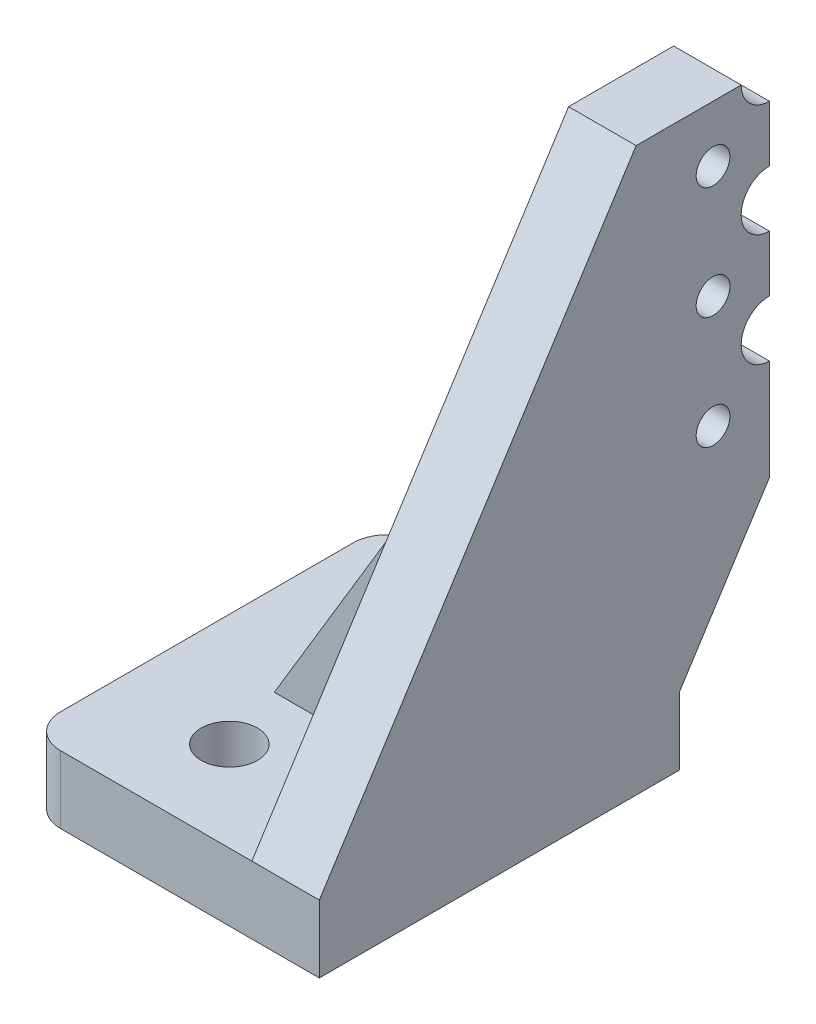
ISO-10303-21;
HEADER;
FILE_DESCRIPTION(('STEP AP214'),'2;1');
FILE_NAME('part.step','',(''),(''),'','','');
FILE_SCHEMA(('AUTOMOTIVE_DESIGN { 1 0 10303 214 1 1 1 1 }'));
ENDSEC;
DATA;
#1=APPLICATION_CONTEXT('core data for automotive mechanical design processes');
#2=APPLICATION_PROTOCOL_DEFINITION('international standard','automotive_design',2000,#1);
#3=PRODUCT_CONTEXT('',#1,'mechanical');
#4=PRODUCT('Part','Part','',(#3));
#5=PRODUCT_RELATED_PRODUCT_CATEGORY('part','',(#4));
#6=PRODUCT_DEFINITION_FORMATION('','',#4);
#7=PRODUCT_DEFINITION_CONTEXT('part definition',#1,'design');
#8=PRODUCT_DEFINITION('design','',#6,#7);
#9=PRODUCT_DEFINITION_SHAPE('','',#8);
#10=(LENGTH_UNIT() NAMED_UNIT(*) SI_UNIT(.MILLI.,.METRE.));
#11=(NAMED_UNIT(*) PLANE_ANGLE_UNIT() SI_UNIT($,.RADIAN.));
#12=(NAMED_UNIT(*) SI_UNIT($,.STERADIAN.) SOLID_ANGLE_UNIT());
#13=UNCERTAINTY_MEASURE_WITH_UNIT(LENGTH_MEASURE(1.E-05),#10,'distance_accuracy_value','');
#14=(GEOMETRIC_REPRESENTATION_CONTEXT(3) GLOBAL_UNCERTAINTY_ASSIGNED_CONTEXT((#13)) GLOBAL_UNIT_ASSIGNED_CONTEXT((#10,
#11,#12)) REPRESENTATION_CONTEXT('',''));
#15=CARTESIAN_POINT('',(0.,0.,0.));
#16=DIRECTION('',(0.,0.,1.));
#17=DIRECTION('',(1.,0.,0.));
#18=AXIS2_PLACEMENT_3D('',#15,#16,#17);
#19=CARTESIAN_POINT('',(-3.,30.,0.));
#20=DIRECTION('',(1.,0.,0.));
#21=DIRECTION('',(0.,0.,-1.));
#22=AXIS2_PLACEMENT_3D('',#19,#20,#21);
#23=PLANE('',#22);
#24=CARTESIAN_POINT('',(-3.,17.5,2.5));
#25=DIRECTION('',(1.,0.,0.));
#26=DIRECTION('',(0.,0.,-1.));
#27=AXIS2_PLACEMENT_3D('',#24,#25,#26);
#28=CIRCLE('',#27,0.750000000000001);
#29=CARTESIAN_POINT('',(-3.,17.5,1.75));
#30=VERTEX_POINT('',#29);
#31=EDGE_CURVE('E351',#30,#30,#28,.F.);
#32=ORIENTED_EDGE('',*,*,#31,.F.);
#33=EDGE_LOOP('',(#32));
#34=FACE_BOUND('',#33,.T.);
#35=CARTESIAN_POINT('',(-3.,22.5,2.5));
#36=DIRECTION('',(1.,0.,0.));
#37=DIRECTION('',(0.,0.,-1.));
#38=AXIS2_PLACEMENT_3D('',#35,#36,#37);
#39=CIRCLE('',#38,0.750000000000001);
#40=CARTESIAN_POINT('',(-3.,22.5,1.75));
#41=VERTEX_POINT('',#40);
#42=EDGE_CURVE('E345',#41,#41,#39,.F.);
#43=ORIENTED_EDGE('',*,*,#42,.F.);
#44=EDGE_LOOP('',(#43));
#45=FACE_BOUND('',#44,.T.);
#46=CARTESIAN_POINT('',(-3.,12.5,2.5));
#47=DIRECTION('',(1.,0.,0.));
#48=DIRECTION('',(0.,0.,-1.));
#49=AXIS2_PLACEMENT_3D('',#46,#47,#48);
#50=CIRCLE('',#49,0.750000000000001);
#51=CARTESIAN_POINT('',(-3.,12.5,1.75));
#52=VERTEX_POINT('',#51);
#53=EDGE_CURVE('E168',#52,#52,#50,.F.);
#54=ORIENTED_EDGE('',*,*,#53,.F.);
#55=EDGE_LOOP('',(#54));
#56=FACE_BOUND('',#55,.T.);
#57=CARTESIAN_POINT('',(-3.,20.,0.));
#58=DIRECTION('',(1.,0.,0.));
#59=DIRECTION('',(0.,0.,-1.));
#60=AXIS2_PLACEMENT_3D('',#57,#58,#59);
#61=CIRCLE('',#60,1.25);
#62=CARTESIAN_POINT('',(-3.,21.25,0.));
#63=VERTEX_POINT('',#62);
#64=CARTESIAN_POINT('',(-3.,18.75,0.));
#65=VERTEX_POINT('',#64);
#66=EDGE_CURVE('E187',#63,#65,#61,.T.);
#67=ORIENTED_EDGE('',*,*,#66,.T.);
#68=DIRECTION('',(0.,1.,0.));
#69=VECTOR('',#68,1.);
#70=CARTESIAN_POINT('',(-3.,0.,0.));
#71=LINE('',#70,#69);
#72=CARTESIAN_POINT('',(-3.,16.25,0.));
#73=VERTEX_POINT('',#72);
#74=EDGE_CURVE('E56',#73,#65,#71,.T.);
#75=ORIENTED_EDGE('',*,*,#74,.F.);
#76=CARTESIAN_POINT('',(-3.,15.,0.));
#77=DIRECTION('',(1.,0.,0.));
#78=DIRECTION('',(0.,0.,-1.));
#79=AXIS2_PLACEMENT_3D('',#76,#77,#78);
#80=CIRCLE('',#79,1.25);
#81=CARTESIAN_POINT('',(-3.,13.75,0.));
#82=VERTEX_POINT('',#81);
#83=EDGE_CURVE('E197',#73,#82,#80,.T.);
#84=ORIENTED_EDGE('',*,*,#83,.T.);
#85=CARTESIAN_POINT('',(-3.,9.25,0.));
#86=VERTEX_POINT('',#85);
#87=EDGE_CURVE('E48',#86,#82,#71,.T.);
#88=ORIENTED_EDGE('',*,*,#87,.F.);
#89=DIRECTION('',(0.,0.842271400661511,-0.539053696423367));
#90=VECTOR('',#89,1.);
#91=CARTESIAN_POINT('',(-3.,15.5,-4.));
#92=LINE('',#91,#90);
#93=CARTESIAN_POINT('',(-3.,3.,4.));
#94=VERTEX_POINT('',#93);
#95=EDGE_CURVE('E215',#94,#86,#92,.T.);
#96=ORIENTED_EDGE('',*,*,#95,.F.);
#97=DIRECTION('',(0.,0.,1.));
#98=VECTOR('',#97,1.);
#99=CARTESIAN_POINT('',(-3.,3.,20.));
#100=LINE('',#99,#98);
#101=CARTESIAN_POINT('',(-3.,3.,11.));
#102=VERTEX_POINT('',#101);
#103=EDGE_CURVE('E283',#94,#102,#100,.T.);
#104=ORIENTED_EDGE('',*,*,#103,.T.);
#105=DIRECTION('',(0.,1.,0.));
#106=VECTOR('',#105,1.);
#107=CARTESIAN_POINT('',(-3.,13.,11.));
#108=LINE('',#107,#106);
#109=CARTESIAN_POINT('',(-3.,13.,11.));
#110=VERTEX_POINT('',#109);
#111=EDGE_CURVE('E178',#102,#110,#108,.T.);
#112=ORIENTED_EDGE('',*,*,#111,.T.);
#113=DIRECTION('',(0.,0.,-1.));
#114=VECTOR('',#113,1.);
#115=CARTESIAN_POINT('',(-3.,13.,13.));
#116=LINE('',#115,#114);
#117=CARTESIAN_POINT('',(-3.,13.,13.));
#118=VERTEX_POINT('',#117);
#119=EDGE_CURVE('E258',#118,#110,#116,.T.);
#120=ORIENTED_EDGE('',*,*,#119,.F.);
#121=DIRECTION('',(0.,1.,0.));
#122=VECTOR('',#121,1.);
#123=CARTESIAN_POINT('',(-3.,13.,13.));
#124=LINE('',#123,#122);
#125=CARTESIAN_POINT('',(-3.,3.,13.));
#126=VERTEX_POINT('',#125);
#127=EDGE_CURVE('E247',#126,#118,#124,.T.);
#128=ORIENTED_EDGE('',*,*,#127,.F.);
#129=CARTESIAN_POINT('',(-3.,3.,20.));
#130=VERTEX_POINT('',#129);
#131=EDGE_CURVE('E282',#126,#130,#100,.T.);
#132=ORIENTED_EDGE('',*,*,#131,.T.);
#133=DIRECTION('',(0.,-0.842271400661511,0.539053696423367));
#134=VECTOR('',#133,1.);
#135=CARTESIAN_POINT('',(-3.,28.,4.));
#136=LINE('',#135,#134);
#137=CARTESIAN_POINT('',(-3.,25.,5.92));
#138=VERTEX_POINT('',#137);
#139=EDGE_CURVE('E177',#138,#130,#136,.T.);
#140=ORIENTED_EDGE('',*,*,#139,.F.);
#141=DIRECTION('',(0.,0.,1.));
#142=VECTOR('',#141,1.);
#143=CARTESIAN_POINT('',(-3.,25.,0.));
#144=LINE('',#143,#142);
#145=CARTESIAN_POINT('',(-3.,25.,1.25));
#146=VERTEX_POINT('',#145);
#147=EDGE_CURVE('E159',#146,#138,#144,.T.);
#148=ORIENTED_EDGE('',*,*,#147,.F.);
#149=CARTESIAN_POINT('',(-3.,25.,0.));
#150=DIRECTION('',(1.,0.,0.));
#151=DIRECTION('',(0.,0.,-1.));
#152=AXIS2_PLACEMENT_3D('',#149,#150,#151);
#153=CIRCLE('',#152,1.25);
#154=CARTESIAN_POINT('',(-3.,23.75,0.));
#155=VERTEX_POINT('',#154);
#156=EDGE_CURVE('E175',#146,#155,#153,.T.);
#157=ORIENTED_EDGE('',*,*,#156,.T.);
#158=EDGE_CURVE('E238',#63,#155,#71,.T.);
#159=ORIENTED_EDGE('',*,*,#158,.F.);
#160=EDGE_LOOP('',(#67,#75,#84,#88,#96,#104,#112,#120,#128,#132,#140,#148,#157,#159));
#161=FACE_BOUND('',#160,.T.);
#162=ADVANCED_FACE('F31',(#34,#45,#56,#161),#23,.F.);
#163=CARTESIAN_POINT('',(-11.5,3.,5.5));
#164=DIRECTION('',(0.,1.,0.));
#165=DIRECTION('',(0.,0.,1.));
#166=AXIS2_PLACEMENT_3D('',#163,#164,#165);
#167=PLANE('',#166);
#168=CARTESIAN_POINT('',(-8.,3.,16.));
#169=DIRECTION('',(0.,-1.,0.));
#170=DIRECTION('',(0.,0.,-1.));
#171=AXIS2_PLACEMENT_3D('',#168,#169,#170);
#172=CIRCLE('',#171,1.25);
#173=CARTESIAN_POINT('',(-8.,3.,14.75));
#174=VERTEX_POINT('',#173);
#175=EDGE_CURVE('E270',#174,#174,#172,.T.);
#176=ORIENTED_EDGE('',*,*,#175,.T.);
#177=EDGE_LOOP('',(#176));
#178=FACE_BOUND('',#177,.T.);
#179=CARTESIAN_POINT('',(-8.,3.,8.));
#180=DIRECTION('',(0.,-1.,0.));
#181=DIRECTION('',(0.,0.,-1.));
#182=AXIS2_PLACEMENT_3D('',#179,#180,#181);
#183=CIRCLE('',#182,1.25);
#184=CARTESIAN_POINT('',(-8.,3.,6.75));
#185=VERTEX_POINT('',#184);
#186=EDGE_CURVE('E264',#185,#185,#183,.T.);
#187=ORIENTED_EDGE('',*,*,#186,.T.);
#188=EDGE_LOOP('',(#187));
#189=FACE_BOUND('',#188,.T.);
#190=ORIENTED_EDGE('',*,*,#131,.F.);
#191=DIRECTION('',(1.,0.,0.));
#192=VECTOR('',#191,1.);
#193=CARTESIAN_POINT('',(-3.,3.,13.));
#194=LINE('',#193,#192);
#195=CARTESIAN_POINT('',(-9.,3.,13.));
#196=VERTEX_POINT('',#195);
#197=EDGE_CURVE('E253',#196,#126,#194,.T.);
#198=ORIENTED_EDGE('',*,*,#197,.F.);
#199=DIRECTION('',(0.,0.,-1.));
#200=VECTOR('',#199,1.);
#201=CARTESIAN_POINT('',(-9.,3.,13.));
#202=LINE('',#201,#200);
#203=CARTESIAN_POINT('',(-9.,3.,11.));
#204=VERTEX_POINT('',#203);
#205=EDGE_CURVE('E256',#196,#204,#202,.T.);
#206=ORIENTED_EDGE('',*,*,#205,.T.);
#207=DIRECTION('',(1.,0.,0.));
#208=VECTOR('',#207,1.);
#209=CARTESIAN_POINT('',(-3.,3.,11.));
#210=LINE('',#209,#208);
#211=EDGE_CURVE('E245',#204,#102,#210,.T.);
#212=ORIENTED_EDGE('',*,*,#211,.T.);
#213=ORIENTED_EDGE('',*,*,#103,.F.);
#214=DIRECTION('',(1.,0.,0.));
#215=VECTOR('',#214,1.);
#216=CARTESIAN_POINT('',(-3.,3.,4.));
#217=LINE('',#216,#215);
#218=CARTESIAN_POINT('',(-11.5,3.,4.));
#219=VERTEX_POINT('',#218);
#220=EDGE_CURVE('E297',#219,#94,#217,.T.);
#221=ORIENTED_EDGE('',*,*,#220,.F.);
#222=CARTESIAN_POINT('',(-11.5,3.,5.5));
#223=DIRECTION('',(0.,-1.,0.));
#224=DIRECTION('',(0.,0.,1.));
#225=AXIS2_PLACEMENT_3D('',#222,#223,#224);
#226=CIRCLE('',#225,1.5);
#227=CARTESIAN_POINT('',(-13.,3.,5.5));
#228=VERTEX_POINT('',#227);
#229=EDGE_CURVE('E294',#228,#219,#226,.T.);
#230=ORIENTED_EDGE('',*,*,#229,.F.);
#231=DIRECTION('',(0.,0.,-1.));
#232=VECTOR('',#231,1.);
#233=CARTESIAN_POINT('',(-13.,3.,18.5));
#234=LINE('',#233,#232);
#235=CARTESIAN_POINT('',(-13.,3.,18.5));
#236=VERTEX_POINT('',#235);
#237=EDGE_CURVE('E291',#236,#228,#234,.T.);
#238=ORIENTED_EDGE('',*,*,#237,.F.);
#239=CARTESIAN_POINT('',(-11.5,3.,18.5));
#240=DIRECTION('',(0.,-1.,0.));
#241=DIRECTION('',(0.,0.,1.));
#242=AXIS2_PLACEMENT_3D('',#239,#240,#241);
#243=CIRCLE('',#242,1.5);
#244=CARTESIAN_POINT('',(-11.5,3.,20.));
#245=VERTEX_POINT('',#244);
#246=EDGE_CURVE('E288',#245,#236,#243,.T.);
#247=ORIENTED_EDGE('',*,*,#246,.F.);
#248=DIRECTION('',(-1.,0.,0.));
#249=VECTOR('',#248,1.);
#250=CARTESIAN_POINT('',(-3.,3.,20.));
#251=LINE('',#250,#249);
#252=EDGE_CURVE('E286',#130,#245,#251,.T.);
#253=ORIENTED_EDGE('',*,*,#252,.F.);
#254=EDGE_LOOP('',(#190,#198,#206,#212,#213,#221,#230,#238,#247,#253));
#255=FACE_BOUND('',#254,.T.);
#256=ADVANCED_FACE('F378',(#178,#189,#255),#167,.T.);
#257=CARTESIAN_POINT('',(-3.,15.5,-4.));
#258=DIRECTION('',(0.,-0.539053696423367,-0.842271400661511));
#259=DIRECTION('',(0.,0.842271400661512,-0.539053696423367));
#260=AXIS2_PLACEMENT_3D('',#257,#258,#259);
#261=PLANE('',#260);
#262=DIRECTION('',(1.,0.,0.));
#263=VECTOR('',#262,1.);
#264=CARTESIAN_POINT('',(-13.001,9.25,0.));
#265=LINE('',#264,#263);
#266=CARTESIAN_POINT('',(0.,9.25,0.));
#267=VERTEX_POINT('',#266);
#268=EDGE_CURVE('E327',#86,#267,#265,.T.);
#269=ORIENTED_EDGE('',*,*,#268,.T.);
#270=DIRECTION('',(0.,0.842271400661511,-0.539053696423367));
#271=VECTOR('',#270,1.);
#272=CARTESIAN_POINT('',(0.,15.5,-4.));
#273=LINE('',#272,#271);
#274=CARTESIAN_POINT('',(0.,3.,4.));
#275=VERTEX_POINT('',#274);
#276=EDGE_CURVE('E211',#275,#267,#273,.T.);
#277=ORIENTED_EDGE('',*,*,#276,.F.);
#278=DIRECTION('',(1.,0.,0.));
#279=VECTOR('',#278,1.);
#280=CARTESIAN_POINT('',(-3.,3.,4.));
#281=LINE('',#280,#279);
#282=EDGE_CURVE('E11',#94,#275,#281,.T.);
#283=ORIENTED_EDGE('',*,*,#282,.F.);
#284=ORIENTED_EDGE('',*,*,#95,.T.);
#285=EDGE_LOOP('',(#269,#277,#283,#284));
#286=FACE_BOUND('',#285,.T.);
#287=ADVANCED_FACE('F325',(#286),#261,.T.);
#288=CARTESIAN_POINT('',(-3.,3.,4.));
#289=DIRECTION('',(0.,0.,-1.));
#290=DIRECTION('',(-1.,0.,0.));
#291=AXIS2_PLACEMENT_3D('',#288,#289,#290);
#292=PLANE('',#291);
#293=DIRECTION('',(0.,1.,0.));
#294=VECTOR('',#293,1.);
#295=CARTESIAN_POINT('',(0.,3.,4.));
#296=LINE('',#295,#294);
#297=CARTESIAN_POINT('',(0.,0.,4.));
#298=VERTEX_POINT('',#297);
#299=EDGE_CURVE('E208',#298,#275,#296,.T.);
#300=ORIENTED_EDGE('',*,*,#299,.F.);
#301=DIRECTION('',(1.,0.,0.));
#302=VECTOR('',#301,1.);
#303=CARTESIAN_POINT('',(-3.,0.,4.));
#304=LINE('',#303,#302);
#305=CARTESIAN_POINT('',(-11.5,0.,4.));
#306=VERTEX_POINT('',#305);
#307=EDGE_CURVE('E40',#306,#298,#304,.T.);
#308=ORIENTED_EDGE('',*,*,#307,.F.);
#309=DIRECTION('',(0.,-1.,0.));
#310=VECTOR('',#309,1.);
#311=CARTESIAN_POINT('',(-11.5,3.,4.));
#312=LINE('',#311,#310);
#313=EDGE_CURVE('E189',#219,#306,#312,.T.);
#314=ORIENTED_EDGE('',*,*,#313,.F.);
#315=ORIENTED_EDGE('',*,*,#220,.T.);
#316=ORIENTED_EDGE('',*,*,#282,.T.);
#317=EDGE_LOOP('',(#300,#308,#314,#315,#316));
#318=FACE_BOUND('',#317,.T.);
#319=ADVANCED_FACE('F318',(#318),#292,.T.);
#320=CARTESIAN_POINT('',(-3.,0.,4.));
#321=DIRECTION('',(0.,-1.,0.));
#322=DIRECTION('',(0.,0.,-1.));
#323=AXIS2_PLACEMENT_3D('',#320,#321,#322);
#324=PLANE('',#323);
#325=DIRECTION('',(0.,0.,-1.));
#326=VECTOR('',#325,1.);
#327=CARTESIAN_POINT('',(0.,0.,4.));
#328=LINE('',#327,#326);
#329=CARTESIAN_POINT('',(0.,0.,20.));
#330=VERTEX_POINT('',#329);
#331=EDGE_CURVE('E205',#330,#298,#328,.T.);
#332=ORIENTED_EDGE('',*,*,#331,.F.);
#333=DIRECTION('',(1.,0.,0.));
#334=VECTOR('',#333,1.);
#335=CARTESIAN_POINT('',(-3.,0.,20.));
#336=LINE('',#335,#334);
#337=CARTESIAN_POINT('',(-11.5,0.,20.));
#338=VERTEX_POINT('',#337);
#339=EDGE_CURVE('E218',#338,#330,#336,.T.);
#340=ORIENTED_EDGE('',*,*,#339,.F.);
#341=CARTESIAN_POINT('',(-11.5,0.,18.5));
#342=DIRECTION('',(0.,-1.,0.));
#343=DIRECTION('',(0.,0.,1.));
#344=AXIS2_PLACEMENT_3D('',#341,#342,#343);
#345=CIRCLE('',#344,1.5);
#346=CARTESIAN_POINT('',(-13.,0.,18.5));
#347=VERTEX_POINT('',#346);
#348=EDGE_CURVE('E273',#338,#347,#345,.T.);
#349=ORIENTED_EDGE('',*,*,#348,.T.);
#350=DIRECTION('',(0.,0.,-1.));
#351=VECTOR('',#350,1.);
#352=CARTESIAN_POINT('',(-13.,0.,18.5));
#353=LINE('',#352,#351);
#354=CARTESIAN_POINT('',(-13.,0.,5.5));
#355=VERTEX_POINT('',#354);
#356=EDGE_CURVE('E276',#347,#355,#353,.T.);
#357=ORIENTED_EDGE('',*,*,#356,.T.);
#358=CARTESIAN_POINT('',(-11.5,0.,5.5));
#359=DIRECTION('',(0.,-1.,0.));
#360=DIRECTION('',(0.,0.,1.));
#361=AXIS2_PLACEMENT_3D('',#358,#359,#360);
#362=CIRCLE('',#361,1.5);
#363=EDGE_CURVE('E279',#355,#306,#362,.T.);
#364=ORIENTED_EDGE('',*,*,#363,.T.);
#365=ORIENTED_EDGE('',*,*,#307,.T.);
#366=EDGE_LOOP('',(#332,#340,#349,#357,#364,#365));
#367=FACE_BOUND('',#366,.T.);
#368=CARTESIAN_POINT('',(-8.,0.,8.));
#369=DIRECTION('',(0.,-1.,0.));
#370=DIRECTION('',(0.,0.,-1.));
#371=AXIS2_PLACEMENT_3D('',#368,#369,#370);
#372=CIRCLE('',#371,1.25);
#373=CARTESIAN_POINT('',(-8.,0.,6.75));
#374=VERTEX_POINT('',#373);
#375=EDGE_CURVE('E261',#374,#374,#372,.T.);
#376=ORIENTED_EDGE('',*,*,#375,.F.);
#377=EDGE_LOOP('',(#376));
#378=FACE_BOUND('',#377,.T.);
#379=CARTESIAN_POINT('',(-8.,0.,16.));
#380=DIRECTION('',(0.,-1.,0.));
#381=DIRECTION('',(0.,0.,-1.));
#382=AXIS2_PLACEMENT_3D('',#379,#380,#381);
#383=CIRCLE('',#382,1.25);
#384=CARTESIAN_POINT('',(-8.,0.,14.75));
#385=VERTEX_POINT('',#384);
#386=EDGE_CURVE('E267',#385,#385,#383,.T.);
#387=ORIENTED_EDGE('',*,*,#386,.F.);
#388=EDGE_LOOP('',(#387));
#389=FACE_BOUND('',#388,.T.);
#390=ADVANCED_FACE('F313',(#367,#378,#389),#324,.T.);
#391=CARTESIAN_POINT('',(-3.,3.,20.));
#392=DIRECTION('',(0.,0.,1.));
#393=DIRECTION('',(1.,0.,0.));
#394=AXIS2_PLACEMENT_3D('',#391,#392,#393);
#395=PLANE('',#394);
#396=DIRECTION('',(0.,-1.,0.));
#397=VECTOR('',#396,1.);
#398=CARTESIAN_POINT('',(0.,3.,20.));
#399=LINE('',#398,#397);
#400=CARTESIAN_POINT('',(0.,3.,20.));
#401=VERTEX_POINT('',#400);
#402=EDGE_CURVE('E202',#401,#330,#399,.T.);
#403=ORIENTED_EDGE('',*,*,#402,.F.);
#404=DIRECTION('',(1.,0.,0.));
#405=VECTOR('',#404,1.);
#406=CARTESIAN_POINT('',(-3.,3.,20.));
#407=LINE('',#406,#405);
#408=EDGE_CURVE('E35',#130,#401,#407,.T.);
#409=ORIENTED_EDGE('',*,*,#408,.F.);
#410=ORIENTED_EDGE('',*,*,#252,.T.);
#411=DIRECTION('',(0.,-1.,0.));
#412=VECTOR('',#411,1.);
#413=CARTESIAN_POINT('',(-11.5,3.,20.));
#414=LINE('',#413,#412);
#415=EDGE_CURVE('E300',#245,#338,#414,.T.);
#416=ORIENTED_EDGE('',*,*,#415,.T.);
#417=ORIENTED_EDGE('',*,*,#339,.T.);
#418=EDGE_LOOP('',(#403,#409,#410,#416,#417));
#419=FACE_BOUND('',#418,.T.);
#420=ADVANCED_FACE('F228',(#419),#395,.T.);
#421=CARTESIAN_POINT('',(-3.,28.,4.));
#422=DIRECTION('',(0.,0.539053696423367,0.842271400661511));
#423=DIRECTION('',(0.,-0.842271400661512,0.539053696423367));
#424=AXIS2_PLACEMENT_3D('',#421,#422,#423);
#425=PLANE('',#424);
#426=DIRECTION('',(-1.,0.,0.));
#427=VECTOR('',#426,1.);
#428=CARTESIAN_POINT('',(-13.001,25.,5.92));
#429=LINE('',#428,#427);
#430=CARTESIAN_POINT('',(0.,25.,5.92));
#431=VERTEX_POINT('',#430);
#432=EDGE_CURVE('E328',#431,#138,#429,.T.);
#433=ORIENTED_EDGE('',*,*,#432,.T.);
#434=ORIENTED_EDGE('',*,*,#139,.T.);
#435=ORIENTED_EDGE('',*,*,#408,.T.);
#436=DIRECTION('',(0.,-0.842271400661511,0.539053696423367));
#437=VECTOR('',#436,1.);
#438=CARTESIAN_POINT('',(0.,28.,4.));
#439=LINE('',#438,#437);
#440=EDGE_CURVE('E200',#431,#401,#439,.T.);
#441=ORIENTED_EDGE('',*,*,#440,.F.);
#442=EDGE_LOOP('',(#433,#434,#435,#441));
#443=FACE_BOUND('',#442,.T.);
#444=ADVANCED_FACE('F33',(#443),#425,.T.);
#445=CARTESIAN_POINT('',(0.,30.,0.));
#446=DIRECTION('',(1.,0.,0.));
#447=DIRECTION('',(0.,0.,-1.));
#448=AXIS2_PLACEMENT_3D('',#445,#446,#447);
#449=PLANE('',#448);
#450=CARTESIAN_POINT('',(0.,17.5,2.5));
#451=DIRECTION('',(1.,0.,0.));
#452=DIRECTION('',(0.,0.,-1.));
#453=AXIS2_PLACEMENT_3D('',#450,#451,#452);
#454=CIRCLE('',#453,0.750000000000001);
#455=CARTESIAN_POINT('',(0.,17.5,1.75));
#456=VERTEX_POINT('',#455);
#457=EDGE_CURVE('E354',#456,#456,#454,.T.);
#458=ORIENTED_EDGE('',*,*,#457,.F.);
#459=EDGE_LOOP('',(#458));
#460=FACE_BOUND('',#459,.T.);
#461=CARTESIAN_POINT('',(0.,22.5,2.5));
#462=DIRECTION('',(1.,0.,0.));
#463=DIRECTION('',(0.,0.,-1.));
#464=AXIS2_PLACEMENT_3D('',#461,#462,#463);
#465=CIRCLE('',#464,0.750000000000001);
#466=CARTESIAN_POINT('',(0.,22.5,1.75));
#467=VERTEX_POINT('',#466);
#468=EDGE_CURVE('E348',#467,#467,#465,.T.);
#469=ORIENTED_EDGE('',*,*,#468,.F.);
#470=EDGE_LOOP('',(#469));
#471=FACE_BOUND('',#470,.T.);
#472=CARTESIAN_POINT('',(0.,12.5,2.5));
#473=DIRECTION('',(1.,0.,0.));
#474=DIRECTION('',(0.,0.,-1.));
#475=AXIS2_PLACEMENT_3D('',#472,#473,#474);
#476=CIRCLE('',#475,0.750000000000001);
#477=CARTESIAN_POINT('',(0.,12.5,1.75));
#478=VERTEX_POINT('',#477);
#479=EDGE_CURVE('E342',#478,#478,#476,.T.);
#480=ORIENTED_EDGE('',*,*,#479,.F.);
#481=EDGE_LOOP('',(#480));
#482=FACE_BOUND('',#481,.T.);
#483=DIRECTION('',(0.,-1.,0.));
#484=VECTOR('',#483,1.);
#485=CARTESIAN_POINT('',(0.,0.,0.));
#486=LINE('',#485,#484);
#487=CARTESIAN_POINT('',(0.,18.75,0.));
#488=VERTEX_POINT('',#487);
#489=CARTESIAN_POINT('',(0.,16.25,0.));
#490=VERTEX_POINT('',#489);
#491=EDGE_CURVE('E235',#488,#490,#486,.T.);
#492=ORIENTED_EDGE('',*,*,#491,.F.);
#493=CARTESIAN_POINT('',(0.,20.,0.));
#494=DIRECTION('',(1.,0.,0.));
#495=DIRECTION('',(0.,0.,-1.));
#496=AXIS2_PLACEMENT_3D('',#493,#494,#495);
#497=CIRCLE('',#496,1.25);
#498=CARTESIAN_POINT('',(0.,21.25,0.));
#499=VERTEX_POINT('',#498);
#500=EDGE_CURVE('E183',#499,#488,#497,.T.);
#501=ORIENTED_EDGE('',*,*,#500,.F.);
#502=CARTESIAN_POINT('',(0.,23.75,0.));
#503=VERTEX_POINT('',#502);
#504=EDGE_CURVE('E179',#503,#499,#486,.T.);
#505=ORIENTED_EDGE('',*,*,#504,.F.);
#506=CARTESIAN_POINT('',(0.,25.,0.));
#507=DIRECTION('',(1.,0.,0.));
#508=DIRECTION('',(0.,0.,-1.));
#509=AXIS2_PLACEMENT_3D('',#506,#507,#508);
#510=CIRCLE('',#509,1.25);
#511=CARTESIAN_POINT('',(0.,25.,1.25));
#512=VERTEX_POINT('',#511);
#513=EDGE_CURVE('E184',#512,#503,#510,.T.);
#514=ORIENTED_EDGE('',*,*,#513,.F.);
#515=DIRECTION('',(0.,0.,-1.));
#516=VECTOR('',#515,1.);
#517=CARTESIAN_POINT('',(0.,25.,0.));
#518=LINE('',#517,#516);
#519=EDGE_CURVE('E162',#431,#512,#518,.T.);
#520=ORIENTED_EDGE('',*,*,#519,.F.);
#521=ORIENTED_EDGE('',*,*,#440,.T.);
#522=ORIENTED_EDGE('',*,*,#402,.T.);
#523=ORIENTED_EDGE('',*,*,#331,.T.);
#524=ORIENTED_EDGE('',*,*,#299,.T.);
#525=ORIENTED_EDGE('',*,*,#276,.T.);
#526=CARTESIAN_POINT('',(0.,13.75,0.));
#527=VERTEX_POINT('',#526);
#528=EDGE_CURVE('E233',#527,#267,#486,.T.);
#529=ORIENTED_EDGE('',*,*,#528,.F.);
#530=CARTESIAN_POINT('',(0.,15.,0.));
#531=DIRECTION('',(1.,0.,0.));
#532=DIRECTION('',(0.,0.,-1.));
#533=AXIS2_PLACEMENT_3D('',#530,#531,#532);
#534=CIRCLE('',#533,1.25);
#535=EDGE_CURVE('E194',#490,#527,#534,.T.);
#536=ORIENTED_EDGE('',*,*,#535,.F.);
#537=EDGE_LOOP('',(#492,#501,#505,#514,#520,#521,#522,#523,#524,#525,#529,#536));
#538=FACE_BOUND('',#537,.T.);
#539=ADVANCED_FACE('F231',(#460,#471,#482,#538),#449,.T.);
#540=CARTESIAN_POINT('',(-3.,15.,0.));
#541=DIRECTION('',(1.,0.,0.));
#542=DIRECTION('',(0.,0.,-1.));
#543=AXIS2_PLACEMENT_3D('',#540,#541,#542);
#544=CYLINDRICAL_SURFACE('',#543,1.25);
#545=ORIENTED_EDGE('',*,*,#83,.F.);
#546=DIRECTION('',(1.,0.,0.));
#547=VECTOR('',#546,1.);
#548=CARTESIAN_POINT('',(-3.,16.25,0.));
#549=LINE('',#548,#547);
#550=EDGE_CURVE('E333',#490,#73,#549,.F.);
#551=ORIENTED_EDGE('',*,*,#550,.F.);
#552=ORIENTED_EDGE('',*,*,#535,.T.);
#553=DIRECTION('',(1.,0.,0.));
#554=VECTOR('',#553,1.);
#555=CARTESIAN_POINT('',(-3.,13.75,0.));
#556=LINE('',#555,#554);
#557=EDGE_CURVE('E329',#82,#527,#556,.T.);
#558=ORIENTED_EDGE('',*,*,#557,.F.);
#559=EDGE_LOOP('',(#545,#551,#552,#558));
#560=FACE_BOUND('',#559,.T.);
#561=ADVANCED_FACE('F363',(#560),#544,.F.);
#562=CARTESIAN_POINT('',(-3.,20.,0.));
#563=DIRECTION('',(1.,0.,0.));
#564=DIRECTION('',(0.,0.,-1.));
#565=AXIS2_PLACEMENT_3D('',#562,#563,#564);
#566=CYLINDRICAL_SURFACE('',#565,1.25);
#567=ORIENTED_EDGE('',*,*,#500,.T.);
#568=DIRECTION('',(1.,0.,0.));
#569=VECTOR('',#568,1.);
#570=CARTESIAN_POINT('',(-3.,18.75,0.));
#571=LINE('',#570,#569);
#572=EDGE_CURVE('E335',#65,#488,#571,.T.);
#573=ORIENTED_EDGE('',*,*,#572,.F.);
#574=ORIENTED_EDGE('',*,*,#66,.F.);
#575=DIRECTION('',(1.,0.,0.));
#576=VECTOR('',#575,1.);
#577=CARTESIAN_POINT('',(-3.,21.25,0.));
#578=LINE('',#577,#576);
#579=EDGE_CURVE('E337',#499,#63,#578,.F.);
#580=ORIENTED_EDGE('',*,*,#579,.F.);
#581=EDGE_LOOP('',(#567,#573,#574,#580));
#582=FACE_BOUND('',#581,.T.);
#583=ADVANCED_FACE('F412',(#582),#566,.F.);
#584=CARTESIAN_POINT('',(-3.,25.,0.));
#585=DIRECTION('',(1.,0.,0.));
#586=DIRECTION('',(0.,0.,-1.));
#587=AXIS2_PLACEMENT_3D('',#584,#585,#586);
#588=CYLINDRICAL_SURFACE('',#587,1.25);
#589=ORIENTED_EDGE('',*,*,#513,.T.);
#590=DIRECTION('',(1.,0.,0.));
#591=VECTOR('',#590,1.);
#592=CARTESIAN_POINT('',(-3.,23.75,0.));
#593=LINE('',#592,#591);
#594=EDGE_CURVE('E167',#155,#503,#593,.T.);
#595=ORIENTED_EDGE('',*,*,#594,.F.);
#596=ORIENTED_EDGE('',*,*,#156,.F.);
#597=DIRECTION('',(1.,0.,0.));
#598=VECTOR('',#597,1.);
#599=CARTESIAN_POINT('',(-3.,25.,1.25));
#600=LINE('',#599,#598);
#601=EDGE_CURVE('E156',#512,#146,#600,.F.);
#602=ORIENTED_EDGE('',*,*,#601,.F.);
#603=EDGE_LOOP('',(#589,#595,#596,#602));
#604=FACE_BOUND('',#603,.T.);
#605=ADVANCED_FACE('F182',(#604),#588,.F.);
#606=CARTESIAN_POINT('',(-11.5,3.,5.5));
#607=DIRECTION('',(0.,-1.,0.));
#608=DIRECTION('',(0.,0.,-1.));
#609=AXIS2_PLACEMENT_3D('',#606,#607,#608);
#610=CYLINDRICAL_SURFACE('',#609,1.5);
#611=ORIENTED_EDGE('',*,*,#363,.F.);
#612=DIRECTION('',(0.,-1.,0.));
#613=VECTOR('',#612,1.);
#614=CARTESIAN_POINT('',(-13.,3.,5.5));
#615=LINE('',#614,#613);
#616=EDGE_CURVE('E303',#228,#355,#615,.T.);
#617=ORIENTED_EDGE('',*,*,#616,.F.);
#618=ORIENTED_EDGE('',*,*,#229,.T.);
#619=ORIENTED_EDGE('',*,*,#313,.T.);
#620=EDGE_LOOP('',(#611,#617,#618,#619));
#621=FACE_BOUND('',#620,.T.);
#622=ADVANCED_FACE('F426',(#621),#610,.T.);
#623=CARTESIAN_POINT('',(-13.,3.,18.5));
#624=DIRECTION('',(-1.,0.,0.));
#625=DIRECTION('',(0.,0.,1.));
#626=AXIS2_PLACEMENT_3D('',#623,#624,#625);
#627=PLANE('',#626);
#628=ORIENTED_EDGE('',*,*,#356,.F.);
#629=DIRECTION('',(0.,-1.,0.));
#630=VECTOR('',#629,1.);
#631=CARTESIAN_POINT('',(-13.,3.,18.5));
#632=LINE('',#631,#630);
#633=EDGE_CURVE('E305',#236,#347,#632,.T.);
#634=ORIENTED_EDGE('',*,*,#633,.F.);
#635=ORIENTED_EDGE('',*,*,#237,.T.);
#636=ORIENTED_EDGE('',*,*,#616,.T.);
#637=EDGE_LOOP('',(#628,#634,#635,#636));
#638=FACE_BOUND('',#637,.T.);
#639=ADVANCED_FACE('F434',(#638),#627,.T.);
#640=CARTESIAN_POINT('',(-11.5,3.,18.5));
#641=DIRECTION('',(0.,-1.,0.));
#642=DIRECTION('',(0.,0.,-1.));
#643=AXIS2_PLACEMENT_3D('',#640,#641,#642);
#644=CYLINDRICAL_SURFACE('',#643,1.5);
#645=ORIENTED_EDGE('',*,*,#348,.F.);
#646=ORIENTED_EDGE('',*,*,#415,.F.);
#647=ORIENTED_EDGE('',*,*,#246,.T.);
#648=ORIENTED_EDGE('',*,*,#633,.T.);
#649=EDGE_LOOP('',(#645,#646,#647,#648));
#650=FACE_BOUND('',#649,.T.);
#651=ADVANCED_FACE('F310',(#650),#644,.T.);
#652=CARTESIAN_POINT('',(-8.,3.,16.));
#653=DIRECTION('',(0.,-1.,0.));
#654=DIRECTION('',(0.,0.,-1.));
#655=AXIS2_PLACEMENT_3D('',#652,#653,#654);
#656=CYLINDRICAL_SURFACE('',#655,1.25);
#657=ORIENTED_EDGE('',*,*,#175,.F.);
#658=EDGE_LOOP('',(#657));
#659=FACE_BOUND('',#658,.T.);
#660=ORIENTED_EDGE('',*,*,#386,.T.);
#661=EDGE_LOOP('',(#660));
#662=FACE_BOUND('',#661,.T.);
#663=ADVANCED_FACE('F449',(#659,#662),#656,.F.);
#664=CARTESIAN_POINT('',(-8.,3.,8.));
#665=DIRECTION('',(0.,-1.,0.));
#666=DIRECTION('',(0.,0.,-1.));
#667=AXIS2_PLACEMENT_3D('',#664,#665,#666);
#668=CYLINDRICAL_SURFACE('',#667,1.25);
#669=ORIENTED_EDGE('',*,*,#186,.F.);
#670=EDGE_LOOP('',(#669));
#671=FACE_BOUND('',#670,.T.);
#672=ORIENTED_EDGE('',*,*,#375,.T.);
#673=EDGE_LOOP('',(#672));
#674=FACE_BOUND('',#673,.T.);
#675=ADVANCED_FACE('F456',(#671,#674),#668,.F.);
#676=CARTESIAN_POINT('',(-9.,3.,13.));
#677=DIRECTION('',(0.857492925712544,-0.514495755427526,0.));
#678=DIRECTION('',(0.514495755427526,0.857492925712544,0.));
#679=AXIS2_PLACEMENT_3D('',#676,#677,#678);
#680=PLANE('',#679);
#681=DIRECTION('',(-0.514495755427526,-0.857492925712544,0.));
#682=VECTOR('',#681,1.);
#683=CARTESIAN_POINT('',(-9.,3.,11.));
#684=LINE('',#683,#682);
#685=EDGE_CURVE('E242',#110,#204,#684,.T.);
#686=ORIENTED_EDGE('',*,*,#685,.T.);
#687=ORIENTED_EDGE('',*,*,#205,.F.);
#688=DIRECTION('',(-0.514495755427526,-0.857492925712544,0.));
#689=VECTOR('',#688,1.);
#690=CARTESIAN_POINT('',(-9.,3.,13.));
#691=LINE('',#690,#689);
#692=EDGE_CURVE('E250',#118,#196,#691,.T.);
#693=ORIENTED_EDGE('',*,*,#692,.F.);
#694=ORIENTED_EDGE('',*,*,#119,.T.);
#695=EDGE_LOOP('',(#686,#687,#693,#694));
#696=FACE_BOUND('',#695,.T.);
#697=ADVANCED_FACE('F464',(#696),#680,.F.);
#698=CARTESIAN_POINT('',(-3.,3.,13.));
#699=DIRECTION('',(0.,0.,-1.));
#700=DIRECTION('',(-1.,0.,0.));
#701=AXIS2_PLACEMENT_3D('',#698,#699,#700);
#702=PLANE('',#701);
#703=ORIENTED_EDGE('',*,*,#127,.T.);
#704=ORIENTED_EDGE('',*,*,#692,.T.);
#705=ORIENTED_EDGE('',*,*,#197,.T.);
#706=EDGE_LOOP('',(#703,#704,#705));
#707=FACE_BOUND('',#706,.T.);
#708=ADVANCED_FACE('F473',(#707),#702,.F.);
#709=CARTESIAN_POINT('',(-3.,3.,11.));
#710=DIRECTION('',(0.,0.,-1.));
#711=DIRECTION('',(-1.,0.,0.));
#712=AXIS2_PLACEMENT_3D('',#709,#710,#711);
#713=PLANE('',#712);
#714=ORIENTED_EDGE('',*,*,#111,.F.);
#715=ORIENTED_EDGE('',*,*,#211,.F.);
#716=ORIENTED_EDGE('',*,*,#685,.F.);
#717=EDGE_LOOP('',(#714,#715,#716));
#718=FACE_BOUND('',#717,.T.);
#719=ADVANCED_FACE('F481',(#718),#713,.T.);
#720=CARTESIAN_POINT('',(-13.001,25.,0.));
#721=DIRECTION('',(0.,-1.,0.));
#722=DIRECTION('',(0.,0.,-1.));
#723=AXIS2_PLACEMENT_3D('',#720,#721,#722);
#724=PLANE('',#723);
#725=ORIENTED_EDGE('',*,*,#519,.T.);
#726=ORIENTED_EDGE('',*,*,#601,.T.);
#727=ORIENTED_EDGE('',*,*,#147,.T.);
#728=ORIENTED_EDGE('',*,*,#432,.F.);
#729=EDGE_LOOP('',(#725,#726,#727,#728));
#730=FACE_BOUND('',#729,.T.);
#731=ADVANCED_FACE('F158',(#730),#724,.F.);
#732=CARTESIAN_POINT('',(-13.001,0.,0.));
#733=DIRECTION('',(0.,0.,1.));
#734=DIRECTION('',(1.,0.,0.));
#735=AXIS2_PLACEMENT_3D('',#732,#733,#734);
#736=PLANE('',#735);
#737=ORIENTED_EDGE('',*,*,#579,.T.);
#738=ORIENTED_EDGE('',*,*,#158,.T.);
#739=ORIENTED_EDGE('',*,*,#594,.T.);
#740=ORIENTED_EDGE('',*,*,#504,.T.);
#741=EDGE_LOOP('',(#737,#738,#739,#740));
#742=FACE_BOUND('',#741,.T.);
#743=ADVANCED_FACE('F495',(#742),#736,.F.);
#744=ORIENTED_EDGE('',*,*,#550,.T.);
#745=ORIENTED_EDGE('',*,*,#74,.T.);
#746=ORIENTED_EDGE('',*,*,#572,.T.);
#747=ORIENTED_EDGE('',*,*,#491,.T.);
#748=EDGE_LOOP('',(#744,#745,#746,#747));
#749=FACE_BOUND('',#748,.T.);
#750=ADVANCED_FACE('F502',(#749),#736,.F.);
#751=ORIENTED_EDGE('',*,*,#87,.T.);
#752=ORIENTED_EDGE('',*,*,#557,.T.);
#753=ORIENTED_EDGE('',*,*,#528,.T.);
#754=ORIENTED_EDGE('',*,*,#268,.F.);
#755=EDGE_LOOP('',(#751,#752,#753,#754));
#756=FACE_BOUND('',#755,.T.);
#757=ADVANCED_FACE('F373',(#756),#736,.F.);
#758=CARTESIAN_POINT('',(-13.001,12.5,2.5));
#759=DIRECTION('',(1.,0.,0.));
#760=DIRECTION('',(0.,0.,-1.));
#761=AXIS2_PLACEMENT_3D('',#758,#759,#760);
#762=CYLINDRICAL_SURFACE('',#761,0.750000000000001);
#763=ORIENTED_EDGE('',*,*,#479,.T.);
#764=EDGE_LOOP('',(#763));
#765=FACE_BOUND('',#764,.T.);
#766=ORIENTED_EDGE('',*,*,#53,.T.);
#767=EDGE_LOOP('',(#766));
#768=FACE_BOUND('',#767,.T.);
#769=ADVANCED_FACE('F369',(#765,#768),#762,.F.);
#770=CARTESIAN_POINT('',(-13.001,22.5,2.5));
#771=DIRECTION('',(1.,0.,0.));
#772=DIRECTION('',(0.,0.,-1.));
#773=AXIS2_PLACEMENT_3D('',#770,#771,#772);
#774=CYLINDRICAL_SURFACE('',#773,0.750000000000001);
#775=ORIENTED_EDGE('',*,*,#468,.T.);
#776=EDGE_LOOP('',(#775));
#777=FACE_BOUND('',#776,.T.);
#778=ORIENTED_EDGE('',*,*,#42,.T.);
#779=EDGE_LOOP('',(#778));
#780=FACE_BOUND('',#779,.T.);
#781=ADVANCED_FACE('F372',(#777,#780),#774,.F.);
#782=CARTESIAN_POINT('',(-13.001,17.5,2.5));
#783=DIRECTION('',(1.,0.,0.));
#784=DIRECTION('',(0.,0.,-1.));
#785=AXIS2_PLACEMENT_3D('',#782,#783,#784);
#786=CYLINDRICAL_SURFACE('',#785,0.750000000000001);
#787=ORIENTED_EDGE('',*,*,#457,.T.);
#788=EDGE_LOOP('',(#787));
#789=FACE_BOUND('',#788,.T.);
#790=ORIENTED_EDGE('',*,*,#31,.T.);
#791=EDGE_LOOP('',(#790));
#792=FACE_BOUND('',#791,.T.);
#793=ADVANCED_FACE('F358',(#789,#792),#786,.F.);
#794=CLOSED_SHELL('',(#162,#256,#287,#319,#390,#420,#444,#539,#561,#583,#605,#622,#639,#651,
#663,#675,#697,#708,#719,#731,#743,#750,#757,#769,#781,#793));
#795=MANIFOLD_SOLID_BREP('B2',#794);
#796=ADVANCED_BREP_SHAPE_REPRESENTATION('',(#18,#795),#14);
#797=SHAPE_DEFINITION_REPRESENTATION(#9,#796);
ENDSEC;
END-ISO-10303-21;
